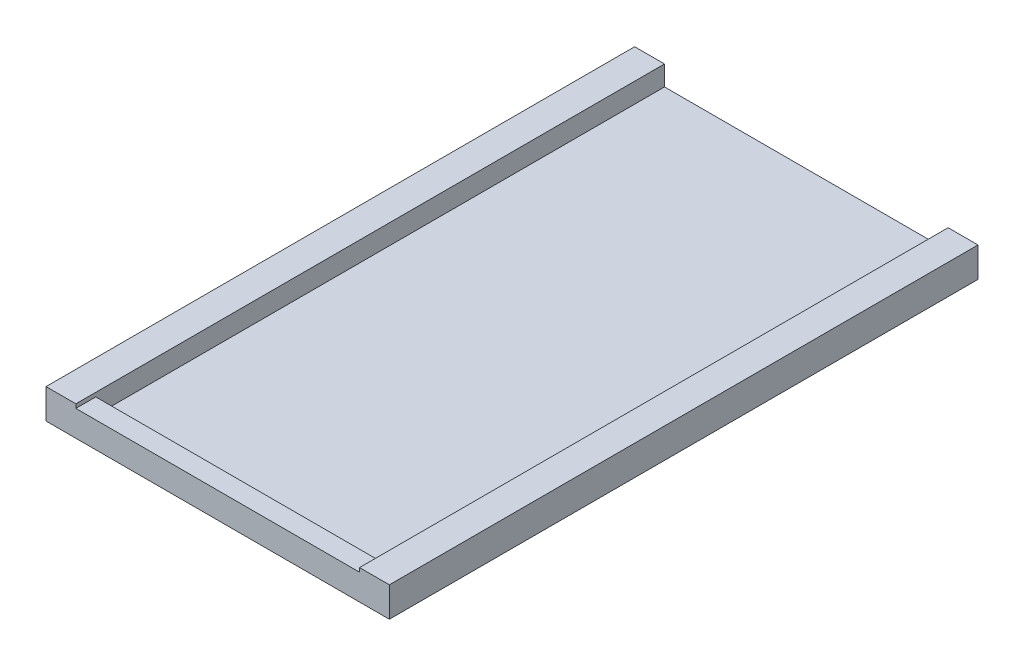
ISO-10303-21;
HEADER;
FILE_DESCRIPTION(('STEP AP214'),'2;1');
FILE_NAME('part.step','',(''),(''),'','','');
FILE_SCHEMA(('AUTOMOTIVE_DESIGN { 1 0 10303 214 1 1 1 1 }'));
ENDSEC;
DATA;
#1=APPLICATION_CONTEXT('core data for automotive mechanical design processes');
#2=APPLICATION_PROTOCOL_DEFINITION('international standard','automotive_design',2000,#1);
#3=PRODUCT_CONTEXT('',#1,'mechanical');
#4=PRODUCT('Part','Part','',(#3));
#5=PRODUCT_RELATED_PRODUCT_CATEGORY('part','',(#4));
#6=PRODUCT_DEFINITION_FORMATION('','',#4);
#7=PRODUCT_DEFINITION_CONTEXT('part definition',#1,'design');
#8=PRODUCT_DEFINITION('design','',#6,#7);
#9=PRODUCT_DEFINITION_SHAPE('','',#8);
#10=(LENGTH_UNIT() NAMED_UNIT(*) SI_UNIT(.MILLI.,.METRE.));
#11=(NAMED_UNIT(*) PLANE_ANGLE_UNIT() SI_UNIT($,.RADIAN.));
#12=(NAMED_UNIT(*) SI_UNIT($,.STERADIAN.) SOLID_ANGLE_UNIT());
#13=UNCERTAINTY_MEASURE_WITH_UNIT(LENGTH_MEASURE(1.E-05),#10,'distance_accuracy_value','');
#14=(GEOMETRIC_REPRESENTATION_CONTEXT(3) GLOBAL_UNCERTAINTY_ASSIGNED_CONTEXT((#13)) GLOBAL_UNIT_ASSIGNED_CONTEXT((#10,
#11,#12)) REPRESENTATION_CONTEXT('',''));
#15=CARTESIAN_POINT('',(0.,0.,0.));
#16=DIRECTION('',(0.,0.,1.));
#17=DIRECTION('',(1.,0.,0.));
#18=AXIS2_PLACEMENT_3D('',#15,#16,#17);
#19=CARTESIAN_POINT('',(14.25,2.6,-59.15));
#20=DIRECTION('',(1.,0.,0.));
#21=DIRECTION('',(0.,0.,-1.));
#22=AXIS2_PLACEMENT_3D('',#19,#20,#21);
#23=PLANE('',#22);
#24=DIRECTION('',(0.,0.,1.));
#25=VECTOR('',#24,1.);
#26=CARTESIAN_POINT('',(14.25,1.,-59.15));
#27=LINE('',#26,#25);
#28=CARTESIAN_POINT('',(14.25,1.,-59.15));
#29=VERTEX_POINT('',#28);
#30=CARTESIAN_POINT('',(14.25,1.,-2.));
#31=VERTEX_POINT('',#30);
#32=EDGE_CURVE('E122',#29,#31,#27,.T.);
#33=ORIENTED_EDGE('',*,*,#32,.T.);
#34=DIRECTION('',(0.,-1.,0.));
#35=VECTOR('',#34,1.);
#36=CARTESIAN_POINT('',(14.25,2.6,-2.));
#37=LINE('',#36,#35);
#38=CARTESIAN_POINT('',(14.25,2.6,-2.));
#39=VERTEX_POINT('',#38);
#40=EDGE_CURVE('E167',#39,#31,#37,.T.);
#41=ORIENTED_EDGE('',*,*,#40,.F.);
#42=DIRECTION('',(0.,0.,1.));
#43=VECTOR('',#42,1.);
#44=CARTESIAN_POINT('',(14.25,2.6,-59.15));
#45=LINE('',#44,#43);
#46=CARTESIAN_POINT('',(14.25,2.6,0.));
#47=VERTEX_POINT('',#46);
#48=EDGE_CURVE('E11',#39,#47,#45,.T.);
#49=ORIENTED_EDGE('',*,*,#48,.T.);
#50=DIRECTION('',(0.,-1.,0.));
#51=VECTOR('',#50,1.);
#52=CARTESIAN_POINT('',(14.25,3.,0.));
#53=LINE('',#52,#51);
#54=CARTESIAN_POINT('',(14.25,3.,0.));
#55=VERTEX_POINT('',#54);
#56=EDGE_CURVE('E158',#55,#47,#53,.T.);
#57=ORIENTED_EDGE('',*,*,#56,.F.);
#58=DIRECTION('',(0.,0.,1.));
#59=VECTOR('',#58,1.);
#60=CARTESIAN_POINT('',(14.25,3.,-59.15));
#61=LINE('',#60,#59);
#62=CARTESIAN_POINT('',(14.25,3.,-59.15));
#63=VERTEX_POINT('',#62);
#64=EDGE_CURVE('E142',#63,#55,#61,.T.);
#65=ORIENTED_EDGE('',*,*,#64,.F.);
#66=DIRECTION('',(0.,-1.,0.));
#67=VECTOR('',#66,1.);
#68=CARTESIAN_POINT('',(14.25,2.6,-59.15));
#69=LINE('',#68,#67);
#70=EDGE_CURVE('E71',#63,#29,#69,.T.);
#71=ORIENTED_EDGE('',*,*,#70,.T.);
#72=EDGE_LOOP('',(#33,#41,#49,#57,#65,#71));
#73=FACE_BOUND('',#72,.T.);
#74=ADVANCED_FACE('F35',(#73),#23,.F.);
#75=CARTESIAN_POINT('',(14.25,2.6,-2.));
#76=DIRECTION('',(0.,0.,1.));
#77=DIRECTION('',(1.,0.,0.));
#78=AXIS2_PLACEMENT_3D('',#75,#76,#77);
#79=PLANE('',#78);
#80=DIRECTION('',(1.,0.,0.));
#81=VECTOR('',#80,1.);
#82=CARTESIAN_POINT('',(14.25,1.,-2.));
#83=LINE('',#82,#81);
#84=CARTESIAN_POINT('',(-14.25,1.,-2.));
#85=VERTEX_POINT('',#84);
#86=EDGE_CURVE('E124',#85,#31,#83,.T.);
#87=ORIENTED_EDGE('',*,*,#86,.F.);
#88=DIRECTION('',(0.,-1.,0.));
#89=VECTOR('',#88,1.);
#90=CARTESIAN_POINT('',(-14.25,2.6,-2.));
#91=LINE('',#90,#89);
#92=CARTESIAN_POINT('',(-14.25,2.6,-2.));
#93=VERTEX_POINT('',#92);
#94=EDGE_CURVE('E133',#93,#85,#91,.T.);
#95=ORIENTED_EDGE('',*,*,#94,.F.);
#96=DIRECTION('',(-1.,0.,0.));
#97=VECTOR('',#96,1.);
#98=CARTESIAN_POINT('',(14.25,2.6,-2.));
#99=LINE('',#98,#97);
#100=EDGE_CURVE('E164',#39,#93,#99,.T.);
#101=ORIENTED_EDGE('',*,*,#100,.F.);
#102=ORIENTED_EDGE('',*,*,#40,.T.);
#103=EDGE_LOOP('',(#87,#95,#101,#102));
#104=FACE_BOUND('',#103,.T.);
#105=ADVANCED_FACE('F213',(#104),#79,.F.);
#106=CARTESIAN_POINT('',(-14.25,2.6,-59.15));
#107=DIRECTION('',(1.,0.,0.));
#108=DIRECTION('',(0.,0.,-1.));
#109=AXIS2_PLACEMENT_3D('',#106,#107,#108);
#110=PLANE('',#109);
#111=ORIENTED_EDGE('',*,*,#94,.T.);
#112=DIRECTION('',(0.,0.,1.));
#113=VECTOR('',#112,1.);
#114=CARTESIAN_POINT('',(-14.25,1.,-59.15));
#115=LINE('',#114,#113);
#116=CARTESIAN_POINT('',(-14.25,1.,-59.15));
#117=VERTEX_POINT('',#116);
#118=EDGE_CURVE('E119',#117,#85,#115,.T.);
#119=ORIENTED_EDGE('',*,*,#118,.F.);
#120=DIRECTION('',(0.,-1.,0.));
#121=VECTOR('',#120,1.);
#122=CARTESIAN_POINT('',(-14.25,2.6,-59.15));
#123=LINE('',#122,#121);
#124=CARTESIAN_POINT('',(-14.25,3.,-59.15));
#125=VERTEX_POINT('',#124);
#126=EDGE_CURVE('E130',#125,#117,#123,.T.);
#127=ORIENTED_EDGE('',*,*,#126,.F.);
#128=DIRECTION('',(0.,0.,1.));
#129=VECTOR('',#128,1.);
#130=CARTESIAN_POINT('',(-14.25,3.,-59.15));
#131=LINE('',#130,#129);
#132=CARTESIAN_POINT('',(-14.25,3.,0.));
#133=VERTEX_POINT('',#132);
#134=EDGE_CURVE('E198',#125,#133,#131,.T.);
#135=ORIENTED_EDGE('',*,*,#134,.T.);
#136=DIRECTION('',(0.,-1.,0.));
#137=VECTOR('',#136,1.);
#138=CARTESIAN_POINT('',(-14.25,3.,0.));
#139=LINE('',#138,#137);
#140=CARTESIAN_POINT('',(-14.25,2.6,0.));
#141=VERTEX_POINT('',#140);
#142=EDGE_CURVE('E196',#133,#141,#139,.T.);
#143=ORIENTED_EDGE('',*,*,#142,.T.);
#144=DIRECTION('',(0.,0.,1.));
#145=VECTOR('',#144,1.);
#146=CARTESIAN_POINT('',(-14.25,2.6,-59.15));
#147=LINE('',#146,#145);
#148=EDGE_CURVE('E134',#93,#141,#147,.T.);
#149=ORIENTED_EDGE('',*,*,#148,.F.);
#150=EDGE_LOOP('',(#111,#119,#127,#135,#143,#149));
#151=FACE_BOUND('',#150,.T.);
#152=ADVANCED_FACE('F128',(#151),#110,.T.);
#153=CARTESIAN_POINT('',(0.,2.6,0.));
#154=DIRECTION('',(0.,0.,-1.));
#155=DIRECTION('',(-1.,0.,0.));
#156=AXIS2_PLACEMENT_3D('',#153,#154,#155);
#157=PLANE('',#156);
#158=DIRECTION('',(1.,0.,0.));
#159=VECTOR('',#158,1.);
#160=CARTESIAN_POINT('',(0.,0.,0.));
#161=LINE('',#160,#159);
#162=CARTESIAN_POINT('',(-17.25,0.,0.));
#163=VERTEX_POINT('',#162);
#164=CARTESIAN_POINT('',(17.25,0.,0.));
#165=VERTEX_POINT('',#164);
#166=EDGE_CURVE('E63',#163,#165,#161,.T.);
#167=ORIENTED_EDGE('',*,*,#166,.T.);
#168=DIRECTION('',(0.,-1.,0.));
#169=VECTOR('',#168,1.);
#170=CARTESIAN_POINT('',(17.25,2.6,0.));
#171=LINE('',#170,#169);
#172=CARTESIAN_POINT('',(17.25,3.,0.));
#173=VERTEX_POINT('',#172);
#174=EDGE_CURVE('E39',#173,#165,#171,.T.);
#175=ORIENTED_EDGE('',*,*,#174,.F.);
#176=DIRECTION('',(1.,0.,0.));
#177=VECTOR('',#176,1.);
#178=CARTESIAN_POINT('',(14.25,3.,0.));
#179=LINE('',#178,#177);
#180=EDGE_CURVE('E151',#55,#173,#179,.T.);
#181=ORIENTED_EDGE('',*,*,#180,.F.);
#182=ORIENTED_EDGE('',*,*,#56,.T.);
#183=DIRECTION('',(1.,0.,0.));
#184=VECTOR('',#183,1.);
#185=CARTESIAN_POINT('',(0.,2.6,0.));
#186=LINE('',#185,#184);
#187=EDGE_CURVE('E162',#141,#47,#186,.T.);
#188=ORIENTED_EDGE('',*,*,#187,.F.);
#189=ORIENTED_EDGE('',*,*,#142,.F.);
#190=DIRECTION('',(-1.,0.,0.));
#191=VECTOR('',#190,1.);
#192=CARTESIAN_POINT('',(-14.25,3.,0.));
#193=LINE('',#192,#191);
#194=CARTESIAN_POINT('',(-17.25,3.,0.));
#195=VERTEX_POINT('',#194);
#196=EDGE_CURVE('E194',#133,#195,#193,.T.);
#197=ORIENTED_EDGE('',*,*,#196,.T.);
#198=DIRECTION('',(0.,-1.,0.));
#199=VECTOR('',#198,1.);
#200=CARTESIAN_POINT('',(-17.25,2.6,0.));
#201=LINE('',#200,#199);
#202=EDGE_CURVE('E145',#195,#163,#201,.T.);
#203=ORIENTED_EDGE('',*,*,#202,.T.);
#204=EDGE_LOOP('',(#167,#175,#181,#182,#188,#189,#197,#203));
#205=FACE_BOUND('',#204,.T.);
#206=ADVANCED_FACE('F37',(#205),#157,.F.);
#207=CARTESIAN_POINT('',(17.25,2.6,0.));
#208=DIRECTION('',(-1.,0.,0.));
#209=DIRECTION('',(0.,0.,1.));
#210=AXIS2_PLACEMENT_3D('',#207,#208,#209);
#211=PLANE('',#210);
#212=DIRECTION('',(0.,0.,-1.));
#213=VECTOR('',#212,1.);
#214=CARTESIAN_POINT('',(17.25,0.,0.));
#215=LINE('',#214,#213);
#216=CARTESIAN_POINT('',(17.25,0.,-59.15));
#217=VERTEX_POINT('',#216);
#218=EDGE_CURVE('E169',#165,#217,#215,.T.);
#219=ORIENTED_EDGE('',*,*,#218,.T.);
#220=DIRECTION('',(0.,-1.,0.));
#221=VECTOR('',#220,1.);
#222=CARTESIAN_POINT('',(17.25,2.6,-59.15));
#223=LINE('',#222,#221);
#224=CARTESIAN_POINT('',(17.25,3.,-59.15));
#225=VERTEX_POINT('',#224);
#226=EDGE_CURVE('E174',#225,#217,#223,.T.);
#227=ORIENTED_EDGE('',*,*,#226,.F.);
#228=DIRECTION('',(0.,0.,-1.));
#229=VECTOR('',#228,1.);
#230=CARTESIAN_POINT('',(17.25,3.,-59.15));
#231=LINE('',#230,#229);
#232=EDGE_CURVE('E154',#173,#225,#231,.T.);
#233=ORIENTED_EDGE('',*,*,#232,.F.);
#234=ORIENTED_EDGE('',*,*,#174,.T.);
#235=EDGE_LOOP('',(#219,#227,#233,#234));
#236=FACE_BOUND('',#235,.T.);
#237=ADVANCED_FACE('F180',(#236),#211,.F.);
#238=CARTESIAN_POINT('',(17.25,2.6,-59.15));
#239=DIRECTION('',(0.,0.,1.));
#240=DIRECTION('',(1.,0.,0.));
#241=AXIS2_PLACEMENT_3D('',#238,#239,#240);
#242=PLANE('',#241);
#243=DIRECTION('',(-1.,0.,0.));
#244=VECTOR('',#243,1.);
#245=CARTESIAN_POINT('',(17.25,0.,-59.15));
#246=LINE('',#245,#244);
#247=CARTESIAN_POINT('',(-17.25,0.,-59.15));
#248=VERTEX_POINT('',#247);
#249=EDGE_CURVE('E165',#217,#248,#246,.T.);
#250=ORIENTED_EDGE('',*,*,#249,.T.);
#251=DIRECTION('',(0.,-1.,0.));
#252=VECTOR('',#251,1.);
#253=CARTESIAN_POINT('',(-17.25,2.6,-59.15));
#254=LINE('',#253,#252);
#255=CARTESIAN_POINT('',(-17.25,3.,-59.15));
#256=VERTEX_POINT('',#255);
#257=EDGE_CURVE('E140',#256,#248,#254,.T.);
#258=ORIENTED_EDGE('',*,*,#257,.F.);
#259=DIRECTION('',(1.,0.,0.));
#260=VECTOR('',#259,1.);
#261=CARTESIAN_POINT('',(-14.25,3.,-59.15));
#262=LINE('',#261,#260);
#263=EDGE_CURVE('E139',#256,#125,#262,.T.);
#264=ORIENTED_EDGE('',*,*,#263,.T.);
#265=ORIENTED_EDGE('',*,*,#126,.T.);
#266=DIRECTION('',(1.,0.,0.));
#267=VECTOR('',#266,1.);
#268=CARTESIAN_POINT('',(14.25,1.,-59.15));
#269=LINE('',#268,#267);
#270=EDGE_CURVE('E116',#117,#29,#269,.T.);
#271=ORIENTED_EDGE('',*,*,#270,.T.);
#272=ORIENTED_EDGE('',*,*,#70,.F.);
#273=DIRECTION('',(-1.,0.,0.));
#274=VECTOR('',#273,1.);
#275=CARTESIAN_POINT('',(14.25,3.,-59.15));
#276=LINE('',#275,#274);
#277=EDGE_CURVE('E157',#225,#63,#276,.T.);
#278=ORIENTED_EDGE('',*,*,#277,.F.);
#279=ORIENTED_EDGE('',*,*,#226,.T.);
#280=EDGE_LOOP('',(#250,#258,#264,#265,#271,#272,#278,#279));
#281=FACE_BOUND('',#280,.T.);
#282=ADVANCED_FACE('F137',(#281),#242,.F.);
#283=CARTESIAN_POINT('',(0.,2.6,0.));
#284=DIRECTION('',(0.,1.,0.));
#285=DIRECTION('',(0.,0.,1.));
#286=AXIS2_PLACEMENT_3D('',#283,#284,#285);
#287=PLANE('',#286);
#288=ORIENTED_EDGE('',*,*,#148,.T.);
#289=ORIENTED_EDGE('',*,*,#187,.T.);
#290=ORIENTED_EDGE('',*,*,#48,.F.);
#291=ORIENTED_EDGE('',*,*,#100,.T.);
#292=EDGE_LOOP('',(#288,#289,#290,#291));
#293=FACE_BOUND('',#292,.T.);
#294=ADVANCED_FACE('F214',(#293),#287,.T.);
#295=CARTESIAN_POINT('',(0.,0.,0.));
#296=DIRECTION('',(0.,1.,0.));
#297=DIRECTION('',(0.,0.,1.));
#298=AXIS2_PLACEMENT_3D('',#295,#296,#297);
#299=PLANE('',#298);
#300=ORIENTED_EDGE('',*,*,#166,.F.);
#301=DIRECTION('',(0.,0.,-1.));
#302=VECTOR('',#301,1.);
#303=CARTESIAN_POINT('',(-17.25,0.,0.));
#304=LINE('',#303,#302);
#305=EDGE_CURVE('E185',#163,#248,#304,.T.);
#306=ORIENTED_EDGE('',*,*,#305,.T.);
#307=ORIENTED_EDGE('',*,*,#249,.F.);
#308=ORIENTED_EDGE('',*,*,#218,.F.);
#309=EDGE_LOOP('',(#300,#306,#307,#308));
#310=FACE_BOUND('',#309,.T.);
#311=ADVANCED_FACE('F182',(#310),#299,.F.);
#312=CARTESIAN_POINT('',(0.,3.,0.));
#313=DIRECTION('',(0.,1.,0.));
#314=DIRECTION('',(0.,0.,1.));
#315=AXIS2_PLACEMENT_3D('',#312,#313,#314);
#316=PLANE('',#315);
#317=ORIENTED_EDGE('',*,*,#64,.T.);
#318=ORIENTED_EDGE('',*,*,#180,.T.);
#319=ORIENTED_EDGE('',*,*,#232,.T.);
#320=ORIENTED_EDGE('',*,*,#277,.T.);
#321=EDGE_LOOP('',(#317,#318,#319,#320));
#322=FACE_BOUND('',#321,.T.);
#323=ADVANCED_FACE('F217',(#322),#316,.T.);
#324=CARTESIAN_POINT('',(-17.25,2.6,0.));
#325=DIRECTION('',(-1.,0.,0.));
#326=DIRECTION('',(0.,0.,1.));
#327=AXIS2_PLACEMENT_3D('',#324,#325,#326);
#328=PLANE('',#327);
#329=ORIENTED_EDGE('',*,*,#305,.F.);
#330=ORIENTED_EDGE('',*,*,#202,.F.);
#331=DIRECTION('',(0.,0.,-1.));
#332=VECTOR('',#331,1.);
#333=CARTESIAN_POINT('',(-17.25,3.,-59.15));
#334=LINE('',#333,#332);
#335=EDGE_CURVE('E190',#195,#256,#334,.T.);
#336=ORIENTED_EDGE('',*,*,#335,.T.);
#337=ORIENTED_EDGE('',*,*,#257,.T.);
#338=EDGE_LOOP('',(#329,#330,#336,#337));
#339=FACE_BOUND('',#338,.T.);
#340=ADVANCED_FACE('F188',(#339),#328,.T.);
#341=CARTESIAN_POINT('',(0.,3.,0.));
#342=DIRECTION('',(0.,1.,0.));
#343=DIRECTION('',(0.,0.,1.));
#344=AXIS2_PLACEMENT_3D('',#341,#342,#343);
#345=PLANE('',#344);
#346=ORIENTED_EDGE('',*,*,#134,.F.);
#347=ORIENTED_EDGE('',*,*,#263,.F.);
#348=ORIENTED_EDGE('',*,*,#335,.F.);
#349=ORIENTED_EDGE('',*,*,#196,.F.);
#350=EDGE_LOOP('',(#346,#347,#348,#349));
#351=FACE_BOUND('',#350,.T.);
#352=ADVANCED_FACE('F206',(#351),#345,.T.);
#353=CARTESIAN_POINT('',(14.25,1.,-59.15));
#354=DIRECTION('',(0.,-1.,0.));
#355=DIRECTION('',(0.,0.,-1.));
#356=AXIS2_PLACEMENT_3D('',#353,#354,#355);
#357=PLANE('',#356);
#358=ORIENTED_EDGE('',*,*,#86,.T.);
#359=ORIENTED_EDGE('',*,*,#32,.F.);
#360=ORIENTED_EDGE('',*,*,#270,.F.);
#361=ORIENTED_EDGE('',*,*,#118,.T.);
#362=EDGE_LOOP('',(#358,#359,#360,#361));
#363=FACE_BOUND('',#362,.T.);
#364=ADVANCED_FACE('F118',(#363),#357,.F.);
#365=CLOSED_SHELL('',(#74,#105,#152,#206,#237,#282,#294,#311,#323,#340,#352,#364));
#366=MANIFOLD_SOLID_BREP('B2',#365);
#367=ADVANCED_BREP_SHAPE_REPRESENTATION('',(#18,#366),#14);
#368=SHAPE_DEFINITION_REPRESENTATION(#9,#367);
ENDSEC;
END-ISO-10303-21;
